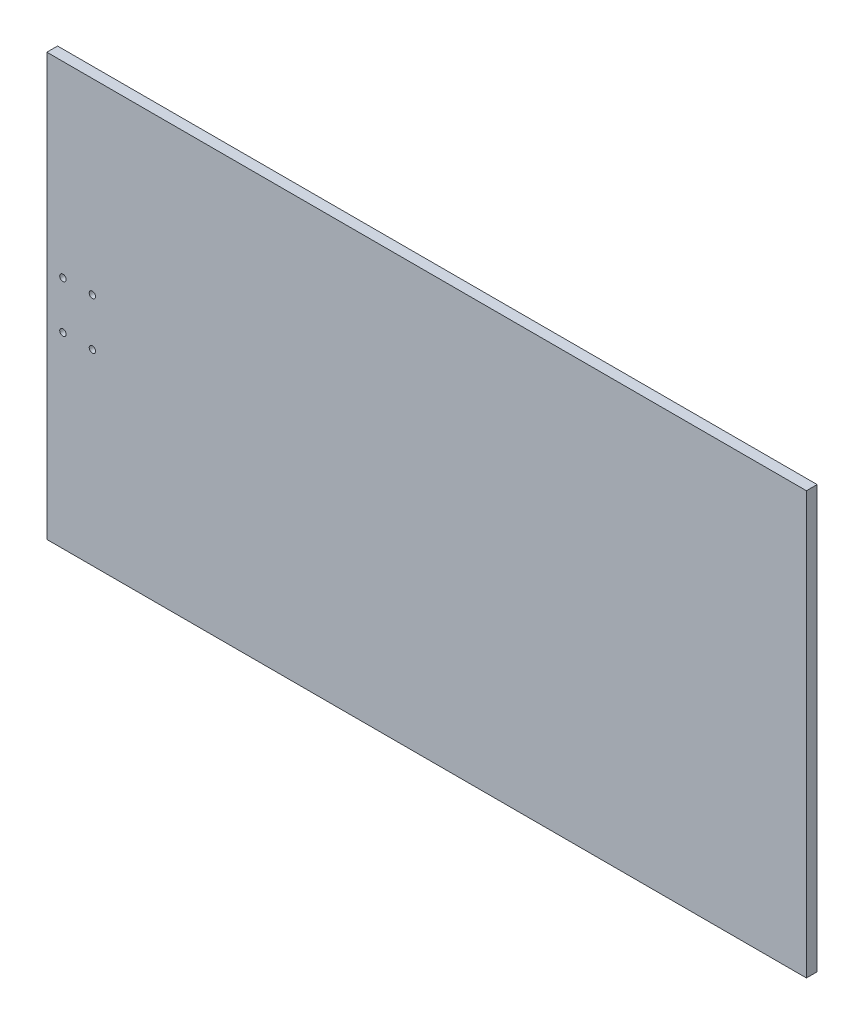
ISO-10303-21;
HEADER;
FILE_DESCRIPTION(('STEP AP214'),'2;1');
FILE_NAME('part.step','',(''),(''),'','','');
FILE_SCHEMA(('AUTOMOTIVE_DESIGN { 1 0 10303 214 1 1 1 1 }'));
ENDSEC;
DATA;
#1=APPLICATION_CONTEXT('core data for automotive mechanical design processes');
#2=APPLICATION_PROTOCOL_DEFINITION('international standard','automotive_design',2000,#1);
#3=PRODUCT_CONTEXT('',#1,'mechanical');
#4=PRODUCT('Part','Part','',(#3));
#5=PRODUCT_RELATED_PRODUCT_CATEGORY('part','',(#4));
#6=PRODUCT_DEFINITION_FORMATION('','',#4);
#7=PRODUCT_DEFINITION_CONTEXT('part definition',#1,'design');
#8=PRODUCT_DEFINITION('design','',#6,#7);
#9=PRODUCT_DEFINITION_SHAPE('','',#8);
#10=(LENGTH_UNIT() NAMED_UNIT(*) SI_UNIT(.MILLI.,.METRE.));
#11=(NAMED_UNIT(*) PLANE_ANGLE_UNIT() SI_UNIT($,.RADIAN.));
#12=(NAMED_UNIT(*) SI_UNIT($,.STERADIAN.) SOLID_ANGLE_UNIT());
#13=UNCERTAINTY_MEASURE_WITH_UNIT(LENGTH_MEASURE(1.E-05),#10,'distance_accuracy_value','');
#14=(GEOMETRIC_REPRESENTATION_CONTEXT(3) GLOBAL_UNCERTAINTY_ASSIGNED_CONTEXT((#13)) GLOBAL_UNIT_ASSIGNED_CONTEXT((#10,
#11,#12)) REPRESENTATION_CONTEXT('',''));
#15=CARTESIAN_POINT('',(0.,0.,0.));
#16=DIRECTION('',(0.,0.,1.));
#17=DIRECTION('',(1.,0.,0.));
#18=AXIS2_PLACEMENT_3D('',#15,#16,#17);
#19=CARTESIAN_POINT('',(225.,-125.,6.35));
#20=DIRECTION('',(-1.,0.,0.));
#21=DIRECTION('',(0.,0.,1.));
#22=AXIS2_PLACEMENT_3D('',#19,#20,#21);
#23=PLANE('',#22);
#24=DIRECTION('',(0.,1.,0.));
#25=VECTOR('',#24,1.);
#26=CARTESIAN_POINT('',(225.,-125.,0.));
#27=LINE('',#26,#25);
#28=CARTESIAN_POINT('',(225.,-125.,0.));
#29=VERTEX_POINT('',#28);
#30=CARTESIAN_POINT('',(225.,125.,0.));
#31=VERTEX_POINT('',#30);
#32=EDGE_CURVE('E106',#29,#31,#27,.T.);
#33=ORIENTED_EDGE('',*,*,#32,.T.);
#34=DIRECTION('',(0.,0.,-1.));
#35=VECTOR('',#34,1.);
#36=CARTESIAN_POINT('',(225.,125.,6.35));
#37=LINE('',#36,#35);
#38=CARTESIAN_POINT('',(225.,125.,6.35));
#39=VERTEX_POINT('',#38);
#40=EDGE_CURVE('E11',#39,#31,#37,.T.);
#41=ORIENTED_EDGE('',*,*,#40,.F.);
#42=DIRECTION('',(0.,1.,0.));
#43=VECTOR('',#42,1.);
#44=CARTESIAN_POINT('',(225.,-125.,6.35));
#45=LINE('',#44,#43);
#46=CARTESIAN_POINT('',(225.,-125.,6.35));
#47=VERTEX_POINT('',#46);
#48=EDGE_CURVE('E90',#47,#39,#45,.T.);
#49=ORIENTED_EDGE('',*,*,#48,.F.);
#50=DIRECTION('',(0.,0.,-1.));
#51=VECTOR('',#50,1.);
#52=CARTESIAN_POINT('',(225.,-125.,6.35));
#53=LINE('',#52,#51);
#54=EDGE_CURVE('E102',#47,#29,#53,.T.);
#55=ORIENTED_EDGE('',*,*,#54,.T.);
#56=EDGE_LOOP('',(#33,#41,#49,#55));
#57=FACE_BOUND('',#56,.T.);
#58=ADVANCED_FACE('F38',(#57),#23,.F.);
#59=CARTESIAN_POINT('',(-225.,125.,6.35));
#60=DIRECTION('',(0.,-1.,0.));
#61=DIRECTION('',(0.,0.,-1.));
#62=AXIS2_PLACEMENT_3D('',#59,#60,#61);
#63=PLANE('',#62);
#64=DIRECTION('',(-1.,0.,0.));
#65=VECTOR('',#64,1.);
#66=CARTESIAN_POINT('',(-225.,125.,0.));
#67=LINE('',#66,#65);
#68=CARTESIAN_POINT('',(-225.,125.,0.));
#69=VERTEX_POINT('',#68);
#70=EDGE_CURVE('E95',#31,#69,#67,.T.);
#71=ORIENTED_EDGE('',*,*,#70,.T.);
#72=DIRECTION('',(0.,0.,-1.));
#73=VECTOR('',#72,1.);
#74=CARTESIAN_POINT('',(-225.,125.,6.35));
#75=LINE('',#74,#73);
#76=CARTESIAN_POINT('',(-225.,125.,6.35));
#77=VERTEX_POINT('',#76);
#78=EDGE_CURVE('E47',#77,#69,#75,.T.);
#79=ORIENTED_EDGE('',*,*,#78,.F.);
#80=DIRECTION('',(-1.,0.,0.));
#81=VECTOR('',#80,1.);
#82=CARTESIAN_POINT('',(-225.,125.,6.35));
#83=LINE('',#82,#81);
#84=EDGE_CURVE('E85',#39,#77,#83,.T.);
#85=ORIENTED_EDGE('',*,*,#84,.F.);
#86=ORIENTED_EDGE('',*,*,#40,.T.);
#87=EDGE_LOOP('',(#71,#79,#85,#86));
#88=FACE_BOUND('',#87,.T.);
#89=ADVANCED_FACE('F94',(#88),#63,.F.);
#90=CARTESIAN_POINT('',(-225.,-125.,6.35));
#91=DIRECTION('',(1.,0.,0.));
#92=DIRECTION('',(0.,0.,-1.));
#93=AXIS2_PLACEMENT_3D('',#90,#91,#92);
#94=PLANE('',#93);
#95=DIRECTION('',(0.,-1.,0.));
#96=VECTOR('',#95,1.);
#97=CARTESIAN_POINT('',(-225.,-125.,0.));
#98=LINE('',#97,#96);
#99=CARTESIAN_POINT('',(-225.,-125.,0.));
#100=VERTEX_POINT('',#99);
#101=EDGE_CURVE('E72',#69,#100,#98,.T.);
#102=ORIENTED_EDGE('',*,*,#101,.T.);
#103=DIRECTION('',(0.,0.,-1.));
#104=VECTOR('',#103,1.);
#105=CARTESIAN_POINT('',(-225.,-125.,6.35));
#106=LINE('',#105,#104);
#107=CARTESIAN_POINT('',(-225.,-125.,6.35));
#108=VERTEX_POINT('',#107);
#109=EDGE_CURVE('E97',#108,#100,#106,.T.);
#110=ORIENTED_EDGE('',*,*,#109,.F.);
#111=DIRECTION('',(0.,-1.,0.));
#112=VECTOR('',#111,1.);
#113=CARTESIAN_POINT('',(-225.,-125.,6.35));
#114=LINE('',#113,#112);
#115=EDGE_CURVE('E88',#77,#108,#114,.T.);
#116=ORIENTED_EDGE('',*,*,#115,.F.);
#117=ORIENTED_EDGE('',*,*,#78,.T.);
#118=EDGE_LOOP('',(#102,#110,#116,#117));
#119=FACE_BOUND('',#118,.T.);
#120=ADVANCED_FACE('F98',(#119),#94,.F.);
#121=CARTESIAN_POINT('',(-225.,-125.,6.35));
#122=DIRECTION('',(0.,1.,0.));
#123=DIRECTION('',(0.,0.,1.));
#124=AXIS2_PLACEMENT_3D('',#121,#122,#123);
#125=PLANE('',#124);
#126=DIRECTION('',(1.,0.,0.));
#127=VECTOR('',#126,1.);
#128=CARTESIAN_POINT('',(-225.,-125.,0.));
#129=LINE('',#128,#127);
#130=EDGE_CURVE('E78',#100,#29,#129,.T.);
#131=ORIENTED_EDGE('',*,*,#130,.T.);
#132=ORIENTED_EDGE('',*,*,#54,.F.);
#133=DIRECTION('',(1.,0.,0.));
#134=VECTOR('',#133,1.);
#135=CARTESIAN_POINT('',(-225.,-125.,6.35));
#136=LINE('',#135,#134);
#137=EDGE_CURVE('E55',#108,#47,#136,.T.);
#138=ORIENTED_EDGE('',*,*,#137,.F.);
#139=ORIENTED_EDGE('',*,*,#109,.T.);
#140=EDGE_LOOP('',(#131,#132,#138,#139));
#141=FACE_BOUND('',#140,.T.);
#142=ADVANCED_FACE('F120',(#141),#125,.F.);
#143=CARTESIAN_POINT('',(0.,0.,6.35));
#144=DIRECTION('',(0.,0.,-1.));
#145=DIRECTION('',(-1.,0.,0.));
#146=AXIS2_PLACEMENT_3D('',#143,#144,#145);
#147=PLANE('',#146);
#148=CARTESIAN_POINT('',(-198.0125,13.9999999999999,6.34999999999999));
#149=DIRECTION('',(0.,0.,-1.));
#150=DIRECTION('',(-1.,0.,0.));
#151=AXIS2_PLACEMENT_3D('',#148,#149,#150);
#152=CIRCLE('',#151,1.89864999999997);
#153=CARTESIAN_POINT('',(-199.91115,13.9999999999999,6.34999999999999));
#154=VERTEX_POINT('',#153);
#155=EDGE_CURVE('E150',#154,#154,#152,.T.);
#156=ORIENTED_EDGE('',*,*,#155,.T.);
#157=EDGE_LOOP('',(#156));
#158=FACE_BOUND('',#157,.T.);
#159=CARTESIAN_POINT('',(-215.475,14.,6.34999999999999));
#160=DIRECTION('',(0.,0.,-1.));
#161=DIRECTION('',(-1.,0.,0.));
#162=AXIS2_PLACEMENT_3D('',#159,#160,#161);
#163=CIRCLE('',#162,1.89864999999997);
#164=CARTESIAN_POINT('',(-217.37365,14.,6.34999999999999));
#165=VERTEX_POINT('',#164);
#166=EDGE_CURVE('E142',#165,#165,#163,.T.);
#167=ORIENTED_EDGE('',*,*,#166,.T.);
#168=EDGE_LOOP('',(#167));
#169=FACE_BOUND('',#168,.T.);
#170=CARTESIAN_POINT('',(-198.0125,-14.,6.34999999999999));
#171=DIRECTION('',(0.,0.,-1.));
#172=DIRECTION('',(-1.,0.,0.));
#173=AXIS2_PLACEMENT_3D('',#170,#171,#172);
#174=CIRCLE('',#173,1.89864999999997);
#175=CARTESIAN_POINT('',(-199.91115,-14.,6.34999999999999));
#176=VERTEX_POINT('',#175);
#177=EDGE_CURVE('E134',#176,#176,#174,.T.);
#178=ORIENTED_EDGE('',*,*,#177,.T.);
#179=EDGE_LOOP('',(#178));
#180=FACE_BOUND('',#179,.T.);
#181=CARTESIAN_POINT('',(-215.475,-14.,6.34999999999999));
#182=DIRECTION('',(0.,0.,-1.));
#183=DIRECTION('',(-1.,0.,0.));
#184=AXIS2_PLACEMENT_3D('',#181,#182,#183);
#185=CIRCLE('',#184,1.89864999999997);
#186=CARTESIAN_POINT('',(-217.37365,-14.,6.34999999999999));
#187=VERTEX_POINT('',#186);
#188=EDGE_CURVE('E110',#187,#187,#185,.T.);
#189=ORIENTED_EDGE('',*,*,#188,.T.);
#190=EDGE_LOOP('',(#189));
#191=FACE_BOUND('',#190,.T.);
#192=ORIENTED_EDGE('',*,*,#48,.T.);
#193=ORIENTED_EDGE('',*,*,#84,.T.);
#194=ORIENTED_EDGE('',*,*,#115,.T.);
#195=ORIENTED_EDGE('',*,*,#137,.T.);
#196=EDGE_LOOP('',(#192,#193,#194,#195));
#197=FACE_BOUND('',#196,.T.);
#198=ADVANCED_FACE('F86',(#158,#169,#180,#191,#197),#147,.F.);
#199=CARTESIAN_POINT('',(0.,0.,0.));
#200=DIRECTION('',(0.,0.,-1.));
#201=DIRECTION('',(-1.,0.,0.));
#202=AXIS2_PLACEMENT_3D('',#199,#200,#201);
#203=PLANE('',#202);
#204=CARTESIAN_POINT('',(-198.0125,13.9999999999999,0.));
#205=DIRECTION('',(0.,0.,-1.));
#206=DIRECTION('',(-1.,0.,0.));
#207=AXIS2_PLACEMENT_3D('',#204,#205,#206);
#208=CIRCLE('',#207,1.89864999999997);
#209=CARTESIAN_POINT('',(-199.91115,13.9999999999999,0.));
#210=VERTEX_POINT('',#209);
#211=EDGE_CURVE('E154',#210,#210,#208,.T.);
#212=ORIENTED_EDGE('',*,*,#211,.F.);
#213=EDGE_LOOP('',(#212));
#214=FACE_BOUND('',#213,.T.);
#215=CARTESIAN_POINT('',(-215.475,14.,0.));
#216=DIRECTION('',(0.,0.,-1.));
#217=DIRECTION('',(-1.,0.,0.));
#218=AXIS2_PLACEMENT_3D('',#215,#216,#217);
#219=CIRCLE('',#218,1.89864999999997);
#220=CARTESIAN_POINT('',(-217.37365,14.,0.));
#221=VERTEX_POINT('',#220);
#222=EDGE_CURVE('E146',#221,#221,#219,.T.);
#223=ORIENTED_EDGE('',*,*,#222,.F.);
#224=EDGE_LOOP('',(#223));
#225=FACE_BOUND('',#224,.T.);
#226=CARTESIAN_POINT('',(-198.0125,-14.,0.));
#227=DIRECTION('',(0.,0.,-1.));
#228=DIRECTION('',(-1.,0.,0.));
#229=AXIS2_PLACEMENT_3D('',#226,#227,#228);
#230=CIRCLE('',#229,1.89864999999997);
#231=CARTESIAN_POINT('',(-199.91115,-14.,0.));
#232=VERTEX_POINT('',#231);
#233=EDGE_CURVE('E138',#232,#232,#230,.T.);
#234=ORIENTED_EDGE('',*,*,#233,.F.);
#235=EDGE_LOOP('',(#234));
#236=FACE_BOUND('',#235,.T.);
#237=CARTESIAN_POINT('',(-215.475,-14.,0.));
#238=DIRECTION('',(0.,0.,-1.));
#239=DIRECTION('',(-1.,0.,0.));
#240=AXIS2_PLACEMENT_3D('',#237,#238,#239);
#241=CIRCLE('',#240,1.89864999999997);
#242=CARTESIAN_POINT('',(-217.37365,-14.,0.));
#243=VERTEX_POINT('',#242);
#244=EDGE_CURVE('E130',#243,#243,#241,.T.);
#245=ORIENTED_EDGE('',*,*,#244,.F.);
#246=EDGE_LOOP('',(#245));
#247=FACE_BOUND('',#246,.T.);
#248=ORIENTED_EDGE('',*,*,#32,.F.);
#249=ORIENTED_EDGE('',*,*,#130,.F.);
#250=ORIENTED_EDGE('',*,*,#101,.F.);
#251=ORIENTED_EDGE('',*,*,#70,.F.);
#252=EDGE_LOOP('',(#248,#249,#250,#251));
#253=FACE_BOUND('',#252,.T.);
#254=ADVANCED_FACE('F123',(#214,#225,#236,#247,#253),#203,.T.);
#255=CARTESIAN_POINT('',(-215.475,-14.,0.));
#256=DIRECTION('',(0.,0.,-1.));
#257=DIRECTION('',(-1.,0.,0.));
#258=AXIS2_PLACEMENT_3D('',#255,#256,#257);
#259=CYLINDRICAL_SURFACE('',#258,1.89864999999997);
#260=ORIENTED_EDGE('',*,*,#188,.F.);
#261=EDGE_LOOP('',(#260));
#262=FACE_BOUND('',#261,.T.);
#263=ORIENTED_EDGE('',*,*,#244,.T.);
#264=EDGE_LOOP('',(#263));
#265=FACE_BOUND('',#264,.T.);
#266=ADVANCED_FACE('F163',(#262,#265),#259,.F.);
#267=CARTESIAN_POINT('',(-198.0125,-14.,0.));
#268=DIRECTION('',(0.,0.,-1.));
#269=DIRECTION('',(-1.,0.,0.));
#270=AXIS2_PLACEMENT_3D('',#267,#268,#269);
#271=CYLINDRICAL_SURFACE('',#270,1.89864999999997);
#272=ORIENTED_EDGE('',*,*,#177,.F.);
#273=EDGE_LOOP('',(#272));
#274=FACE_BOUND('',#273,.T.);
#275=ORIENTED_EDGE('',*,*,#233,.T.);
#276=EDGE_LOOP('',(#275));
#277=FACE_BOUND('',#276,.T.);
#278=ADVANCED_FACE('F172',(#274,#277),#271,.F.);
#279=CARTESIAN_POINT('',(-215.475,14.,0.));
#280=DIRECTION('',(0.,0.,-1.));
#281=DIRECTION('',(-1.,0.,0.));
#282=AXIS2_PLACEMENT_3D('',#279,#280,#281);
#283=CYLINDRICAL_SURFACE('',#282,1.89864999999997);
#284=ORIENTED_EDGE('',*,*,#166,.F.);
#285=EDGE_LOOP('',(#284));
#286=FACE_BOUND('',#285,.T.);
#287=ORIENTED_EDGE('',*,*,#222,.T.);
#288=EDGE_LOOP('',(#287));
#289=FACE_BOUND('',#288,.T.);
#290=ADVANCED_FACE('F179',(#286,#289),#283,.F.);
#291=CARTESIAN_POINT('',(-198.0125,13.9999999999999,0.));
#292=DIRECTION('',(0.,0.,-1.));
#293=DIRECTION('',(-1.,0.,0.));
#294=AXIS2_PLACEMENT_3D('',#291,#292,#293);
#295=CYLINDRICAL_SURFACE('',#294,1.89864999999997);
#296=ORIENTED_EDGE('',*,*,#155,.F.);
#297=EDGE_LOOP('',(#296));
#298=FACE_BOUND('',#297,.T.);
#299=ORIENTED_EDGE('',*,*,#211,.T.);
#300=EDGE_LOOP('',(#299));
#301=FACE_BOUND('',#300,.T.);
#302=ADVANCED_FACE('F159',(#298,#301),#295,.F.);
#303=CLOSED_SHELL('',(#58,#89,#120,#142,#198,#254,#266,#278,#290,#302));
#304=MANIFOLD_SOLID_BREP('B2',#303);
#305=ADVANCED_BREP_SHAPE_REPRESENTATION('',(#18,#304),#14);
#306=SHAPE_DEFINITION_REPRESENTATION(#9,#305);
ENDSEC;
END-ISO-10303-21;
